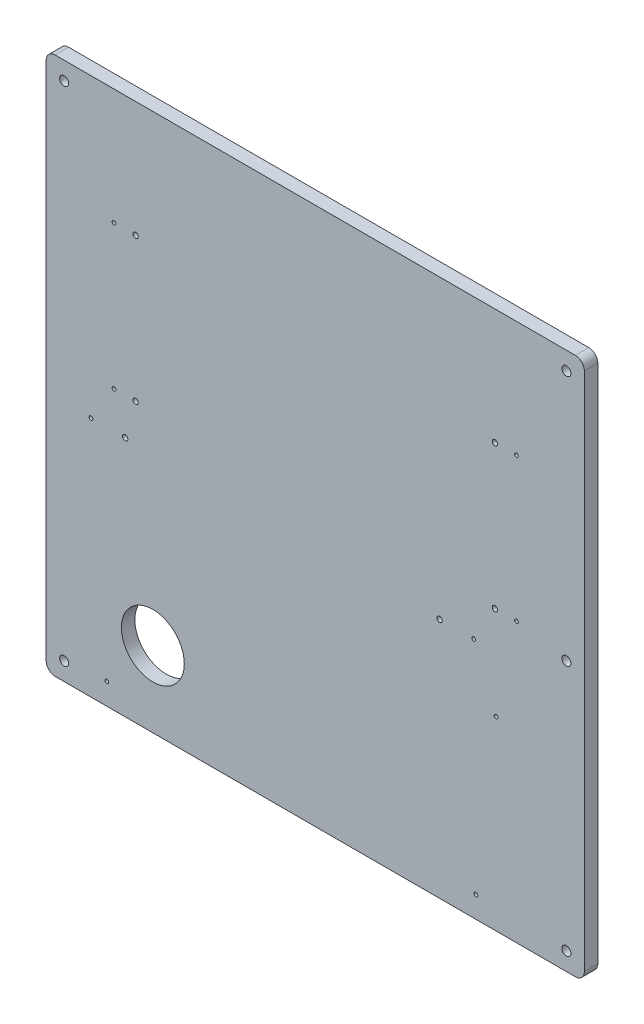
ISO-10303-21;
HEADER;
FILE_DESCRIPTION(('STEP AP214'),'2;1');
FILE_NAME('part.step','',(''),(''),'','','');
FILE_SCHEMA(('AUTOMOTIVE_DESIGN { 1 0 10303 214 1 1 1 1 }'));
ENDSEC;
DATA;
#1=APPLICATION_CONTEXT('core data for automotive mechanical design processes');
#2=APPLICATION_PROTOCOL_DEFINITION('international standard','automotive_design',2000,#1);
#3=PRODUCT_CONTEXT('',#1,'mechanical');
#4=PRODUCT('Part','Part','',(#3));
#5=PRODUCT_RELATED_PRODUCT_CATEGORY('part','',(#4));
#6=PRODUCT_DEFINITION_FORMATION('','',#4);
#7=PRODUCT_DEFINITION_CONTEXT('part definition',#1,'design');
#8=PRODUCT_DEFINITION('design','',#6,#7);
#9=PRODUCT_DEFINITION_SHAPE('','',#8);
#10=(LENGTH_UNIT() NAMED_UNIT(*) SI_UNIT(.MILLI.,.METRE.));
#11=(NAMED_UNIT(*) PLANE_ANGLE_UNIT() SI_UNIT($,.RADIAN.));
#12=(NAMED_UNIT(*) SI_UNIT($,.STERADIAN.) SOLID_ANGLE_UNIT());
#13=UNCERTAINTY_MEASURE_WITH_UNIT(LENGTH_MEASURE(1.E-05),#10,'distance_accuracy_value','');
#14=(GEOMETRIC_REPRESENTATION_CONTEXT(3) GLOBAL_UNCERTAINTY_ASSIGNED_CONTEXT((#13)) GLOBAL_UNIT_ASSIGNED_CONTEXT((#10,
#11,#12)) REPRESENTATION_CONTEXT('',''));
#15=CARTESIAN_POINT('',(0.,0.,0.));
#16=DIRECTION('',(0.,0.,1.));
#17=DIRECTION('',(1.,0.,0.));
#18=AXIS2_PLACEMENT_3D('',#15,#16,#17);
#19=CARTESIAN_POINT('',(299.5,-299.5,15.));
#20=DIRECTION('',(-1.,0.,0.));
#21=DIRECTION('',(0.,0.,1.));
#22=AXIS2_PLACEMENT_3D('',#19,#20,#21);
#23=PLANE('',#22);
#24=DIRECTION('',(0.,1.,0.));
#25=VECTOR('',#24,1.);
#26=CARTESIAN_POINT('',(299.5,-299.5,15.));
#27=LINE('',#26,#25);
#28=CARTESIAN_POINT('',(299.5,-289.5,15.));
#29=VERTEX_POINT('',#28);
#30=CARTESIAN_POINT('',(299.5,289.5,15.));
#31=VERTEX_POINT('',#30);
#32=EDGE_CURVE('E119',#29,#31,#27,.T.);
#33=ORIENTED_EDGE('',*,*,#32,.F.);
#34=DIRECTION('',(0.,0.,-1.));
#35=VECTOR('',#34,1.);
#36=CARTESIAN_POINT('',(299.5,-289.5,15.));
#37=LINE('',#36,#35);
#38=CARTESIAN_POINT('',(299.5,-289.5,0.));
#39=VERTEX_POINT('',#38);
#40=EDGE_CURVE('E104',#29,#39,#37,.T.);
#41=ORIENTED_EDGE('',*,*,#40,.T.);
#42=DIRECTION('',(0.,1.,0.));
#43=VECTOR('',#42,1.);
#44=CARTESIAN_POINT('',(299.5,-299.5,0.));
#45=LINE('',#44,#43);
#46=CARTESIAN_POINT('',(299.5,289.5,0.));
#47=VERTEX_POINT('',#46);
#48=EDGE_CURVE('E116',#39,#47,#45,.T.);
#49=ORIENTED_EDGE('',*,*,#48,.T.);
#50=DIRECTION('',(0.,0.,-1.));
#51=VECTOR('',#50,1.);
#52=CARTESIAN_POINT('',(299.5,289.5,15.));
#53=LINE('',#52,#51);
#54=EDGE_CURVE('E121',#47,#31,#53,.F.);
#55=ORIENTED_EDGE('',*,*,#54,.T.);
#56=EDGE_LOOP('',(#33,#41,#49,#55));
#57=FACE_BOUND('',#56,.T.);
#58=ADVANCED_FACE('F34',(#57),#23,.F.);
#59=CARTESIAN_POINT('',(-299.5,299.5,15.));
#60=DIRECTION('',(0.,-1.,0.));
#61=DIRECTION('',(0.,0.,-1.));
#62=AXIS2_PLACEMENT_3D('',#59,#60,#61);
#63=PLANE('',#62);
#64=DIRECTION('',(-1.,0.,0.));
#65=VECTOR('',#64,1.);
#66=CARTESIAN_POINT('',(-299.5,299.5,15.));
#67=LINE('',#66,#65);
#68=CARTESIAN_POINT('',(289.5,299.5,15.));
#69=VERTEX_POINT('',#68);
#70=CARTESIAN_POINT('',(-289.5,299.5,15.));
#71=VERTEX_POINT('',#70);
#72=EDGE_CURVE('E165',#69,#71,#67,.T.);
#73=ORIENTED_EDGE('',*,*,#72,.F.);
#74=DIRECTION('',(0.,0.,-1.));
#75=VECTOR('',#74,1.);
#76=CARTESIAN_POINT('',(289.5,299.5,15.));
#77=LINE('',#76,#75);
#78=CARTESIAN_POINT('',(289.5,299.5,0.));
#79=VERTEX_POINT('',#78);
#80=EDGE_CURVE('E158',#69,#79,#77,.T.);
#81=ORIENTED_EDGE('',*,*,#80,.T.);
#82=DIRECTION('',(-1.,0.,0.));
#83=VECTOR('',#82,1.);
#84=CARTESIAN_POINT('',(-299.5,299.5,0.));
#85=LINE('',#84,#83);
#86=CARTESIAN_POINT('',(-289.5,299.5,0.));
#87=VERTEX_POINT('',#86);
#88=EDGE_CURVE('E125',#79,#87,#85,.T.);
#89=ORIENTED_EDGE('',*,*,#88,.T.);
#90=DIRECTION('',(0.,0.,-1.));
#91=VECTOR('',#90,1.);
#92=CARTESIAN_POINT('',(-289.5,299.5,15.));
#93=LINE('',#92,#91);
#94=EDGE_CURVE('E156',#87,#71,#93,.F.);
#95=ORIENTED_EDGE('',*,*,#94,.T.);
#96=EDGE_LOOP('',(#73,#81,#89,#95));
#97=FACE_BOUND('',#96,.T.);
#98=ADVANCED_FACE('F163',(#97),#63,.F.);
#99=CARTESIAN_POINT('',(-299.5,-299.5,15.));
#100=DIRECTION('',(1.,0.,0.));
#101=DIRECTION('',(0.,0.,-1.));
#102=AXIS2_PLACEMENT_3D('',#99,#100,#101);
#103=PLANE('',#102);
#104=DIRECTION('',(0.,-1.,0.));
#105=VECTOR('',#104,1.);
#106=CARTESIAN_POINT('',(-299.5,-299.5,15.));
#107=LINE('',#106,#105);
#108=CARTESIAN_POINT('',(-299.5,289.5,15.));
#109=VERTEX_POINT('',#108);
#110=CARTESIAN_POINT('',(-299.5,-289.5,15.));
#111=VERTEX_POINT('',#110);
#112=EDGE_CURVE('E173',#109,#111,#107,.T.);
#113=ORIENTED_EDGE('',*,*,#112,.F.);
#114=DIRECTION('',(0.,0.,-1.));
#115=VECTOR('',#114,1.);
#116=CARTESIAN_POINT('',(-299.5,289.5,15.));
#117=LINE('',#116,#115);
#118=CARTESIAN_POINT('',(-299.5,289.5,0.));
#119=VERTEX_POINT('',#118);
#120=EDGE_CURVE('E11',#109,#119,#117,.T.);
#121=ORIENTED_EDGE('',*,*,#120,.T.);
#122=DIRECTION('',(0.,-1.,0.));
#123=VECTOR('',#122,1.);
#124=CARTESIAN_POINT('',(-299.5,-299.5,0.));
#125=LINE('',#124,#123);
#126=CARTESIAN_POINT('',(-299.5,-289.5,0.));
#127=VERTEX_POINT('',#126);
#128=EDGE_CURVE('E129',#119,#127,#125,.T.);
#129=ORIENTED_EDGE('',*,*,#128,.T.);
#130=DIRECTION('',(0.,0.,-1.));
#131=VECTOR('',#130,1.);
#132=CARTESIAN_POINT('',(-299.5,-289.5,15.));
#133=LINE('',#132,#131);
#134=EDGE_CURVE('E42',#127,#111,#133,.F.);
#135=ORIENTED_EDGE('',*,*,#134,.T.);
#136=EDGE_LOOP('',(#113,#121,#129,#135));
#137=FACE_BOUND('',#136,.T.);
#138=ADVANCED_FACE('F172',(#137),#103,.F.);
#139=CARTESIAN_POINT('',(-299.5,-299.5,15.));
#140=DIRECTION('',(0.,1.,0.));
#141=DIRECTION('',(0.,0.,1.));
#142=AXIS2_PLACEMENT_3D('',#139,#140,#141);
#143=PLANE('',#142);
#144=DIRECTION('',(1.,0.,0.));
#145=VECTOR('',#144,1.);
#146=CARTESIAN_POINT('',(-299.5,-299.5,0.));
#147=LINE('',#146,#145);
#148=CARTESIAN_POINT('',(-289.5,-299.5,0.));
#149=VERTEX_POINT('',#148);
#150=CARTESIAN_POINT('',(289.5,-299.5,0.));
#151=VERTEX_POINT('',#150);
#152=EDGE_CURVE('E139',#149,#151,#147,.T.);
#153=ORIENTED_EDGE('',*,*,#152,.T.);
#154=DIRECTION('',(0.,0.,-1.));
#155=VECTOR('',#154,1.);
#156=CARTESIAN_POINT('',(289.5,-299.5,15.));
#157=LINE('',#156,#155);
#158=CARTESIAN_POINT('',(289.5,-299.5,15.));
#159=VERTEX_POINT('',#158);
#160=EDGE_CURVE('E105',#151,#159,#157,.F.);
#161=ORIENTED_EDGE('',*,*,#160,.T.);
#162=DIRECTION('',(1.,0.,0.));
#163=VECTOR('',#162,1.);
#164=CARTESIAN_POINT('',(-299.5,-299.5,15.));
#165=LINE('',#164,#163);
#166=CARTESIAN_POINT('',(-289.5,-299.5,15.));
#167=VERTEX_POINT('',#166);
#168=EDGE_CURVE('E135',#167,#159,#165,.T.);
#169=ORIENTED_EDGE('',*,*,#168,.F.);
#170=DIRECTION('',(0.,0.,-1.));
#171=VECTOR('',#170,1.);
#172=CARTESIAN_POINT('',(-289.5,-299.5,15.));
#173=LINE('',#172,#171);
#174=EDGE_CURVE('E110',#167,#149,#173,.T.);
#175=ORIENTED_EDGE('',*,*,#174,.T.);
#176=EDGE_LOOP('',(#153,#161,#169,#175));
#177=FACE_BOUND('',#176,.T.);
#178=ADVANCED_FACE('F315',(#177),#143,.F.);
#179=CARTESIAN_POINT('',(0.,0.,15.));
#180=DIRECTION('',(0.,0.,-1.));
#181=DIRECTION('',(-1.,0.,0.));
#182=AXIS2_PLACEMENT_3D('',#179,#180,#181);
#183=PLANE('',#182);
#184=CARTESIAN_POINT('',(224.,170.5,15.));
#185=DIRECTION('',(0.,0.,1.));
#186=DIRECTION('',(1.,0.,0.));
#187=AXIS2_PLACEMENT_3D('',#184,#185,#186);
#188=CIRCLE('',#187,2.09999999999999);
#189=CARTESIAN_POINT('',(226.1,170.5,15.));
#190=VERTEX_POINT('',#189);
#191=EDGE_CURVE('E273',#190,#190,#188,.T.);
#192=ORIENTED_EDGE('',*,*,#191,.F.);
#193=EDGE_LOOP('',(#192));
#194=FACE_BOUND('',#193,.T.);
#195=CARTESIAN_POINT('',(224.,10.5000000000004,15.));
#196=DIRECTION('',(0.,0.,1.));
#197=DIRECTION('',(1.,0.,0.));
#198=AXIS2_PLACEMENT_3D('',#195,#196,#197);
#199=CIRCLE('',#198,2.09999999999999);
#200=CARTESIAN_POINT('',(226.1,10.5000000000004,15.));
#201=VERTEX_POINT('',#200);
#202=EDGE_CURVE('E267',#201,#201,#199,.T.);
#203=ORIENTED_EDGE('',*,*,#202,.F.);
#204=EDGE_LOOP('',(#203));
#205=FACE_BOUND('',#204,.T.);
#206=CARTESIAN_POINT('',(201.236161146576,-92.9824590337128,15.));
#207=DIRECTION('',(0.,0.,1.));
#208=DIRECTION('',(1.,0.,0.));
#209=AXIS2_PLACEMENT_3D('',#206,#207,#208);
#210=CIRCLE('',#209,2.09999999999999);
#211=CARTESIAN_POINT('',(203.336161146576,-92.9824590337128,15.));
#212=VERTEX_POINT('',#211);
#213=EDGE_CURVE('E261',#212,#212,#210,.T.);
#214=ORIENTED_EDGE('',*,*,#213,.F.);
#215=EDGE_LOOP('',(#214));
#216=FACE_BOUND('',#215,.T.);
#217=CARTESIAN_POINT('',(178.84999999997,-275.5,15.));
#218=DIRECTION('',(0.,0.,1.));
#219=DIRECTION('',(1.,0.,0.));
#220=AXIS2_PLACEMENT_3D('',#217,#218,#219);
#221=CIRCLE('',#220,2.09999999999999);
#222=CARTESIAN_POINT('',(180.94999999997,-275.5,15.));
#223=VERTEX_POINT('',#222);
#224=EDGE_CURVE('E254',#223,#223,#221,.T.);
#225=ORIENTED_EDGE('',*,*,#224,.F.);
#226=EDGE_LOOP('',(#225));
#227=FACE_BOUND('',#226,.T.);
#228=CARTESIAN_POINT('',(-231.950000000024,-275.5,15.));
#229=DIRECTION('',(0.,0.,1.));
#230=DIRECTION('',(1.,0.,0.));
#231=AXIS2_PLACEMENT_3D('',#228,#229,#230);
#232=CIRCLE('',#231,2.09999999999999);
#233=CARTESIAN_POINT('',(-229.850000000024,-275.5,15.));
#234=VERTEX_POINT('',#233);
#235=EDGE_CURVE('E296',#234,#234,#232,.T.);
#236=ORIENTED_EDGE('',*,*,#235,.F.);
#237=EDGE_LOOP('',(#236));
#238=FACE_BOUND('',#237,.T.);
#239=CARTESIAN_POINT('',(-249.600000000029,-30.5000000000001,15.));
#240=DIRECTION('',(0.,0.,1.));
#241=DIRECTION('',(1.,0.,0.));
#242=AXIS2_PLACEMENT_3D('',#239,#240,#241);
#243=CIRCLE('',#242,2.09999999999999);
#244=CARTESIAN_POINT('',(-247.500000000029,-30.5000000000001,15.));
#245=VERTEX_POINT('',#244);
#246=EDGE_CURVE('E290',#245,#245,#243,.T.);
#247=ORIENTED_EDGE('',*,*,#246,.F.);
#248=EDGE_LOOP('',(#247));
#249=FACE_BOUND('',#248,.T.);
#250=CARTESIAN_POINT('',(-224.,10.5000000000002,15.));
#251=DIRECTION('',(0.,0.,1.));
#252=DIRECTION('',(1.,0.,0.));
#253=AXIS2_PLACEMENT_3D('',#250,#251,#252);
#254=CIRCLE('',#253,2.09999999999999);
#255=CARTESIAN_POINT('',(-221.9,10.5000000000002,15.));
#256=VERTEX_POINT('',#255);
#257=EDGE_CURVE('E284',#256,#256,#254,.T.);
#258=ORIENTED_EDGE('',*,*,#257,.F.);
#259=EDGE_LOOP('',(#258));
#260=FACE_BOUND('',#259,.T.);
#261=CARTESIAN_POINT('',(176.399999999971,-30.5000000000001,15.));
#262=DIRECTION('',(0.,0.,1.));
#263=DIRECTION('',(1.,0.,0.));
#264=AXIS2_PLACEMENT_3D('',#261,#262,#263);
#265=CIRCLE('',#264,2.09999999999999);
#266=CARTESIAN_POINT('',(178.499999999971,-30.5000000000001,15.));
#267=VERTEX_POINT('',#266);
#268=EDGE_CURVE('E278',#267,#267,#265,.T.);
#269=ORIENTED_EDGE('',*,*,#268,.F.);
#270=EDGE_LOOP('',(#269));
#271=FACE_BOUND('',#270,.T.);
#272=CARTESIAN_POINT('',(-224.,170.500000000001,15.));
#273=DIRECTION('',(0.,0.,1.));
#274=DIRECTION('',(1.,0.,0.));
#275=AXIS2_PLACEMENT_3D('',#272,#273,#274);
#276=CIRCLE('',#275,2.09999999999999);
#277=CARTESIAN_POINT('',(-221.9,170.500000000001,15.));
#278=VERTEX_POINT('',#277);
#279=EDGE_CURVE('E248',#278,#278,#276,.T.);
#280=ORIENTED_EDGE('',*,*,#279,.F.);
#281=EDGE_LOOP('',(#280));
#282=FACE_BOUND('',#281,.T.);
#283=CARTESIAN_POINT('',(-211.600000000029,-30.5000000000001,15.));
#284=DIRECTION('',(0.,0.,1.));
#285=DIRECTION('',(1.,0.,0.));
#286=AXIS2_PLACEMENT_3D('',#283,#284,#285);
#287=CIRCLE('',#286,2.99999999999999);
#288=CARTESIAN_POINT('',(-208.600000000029,-30.5000000000001,15.));
#289=VERTEX_POINT('',#288);
#290=EDGE_CURVE('E218',#289,#289,#287,.T.);
#291=ORIENTED_EDGE('',*,*,#290,.F.);
#292=EDGE_LOOP('',(#291));
#293=FACE_BOUND('',#292,.T.);
#294=CARTESIAN_POINT('',(-199.999999999994,10.4999999999996,15.));
#295=DIRECTION('',(0.,0.,1.));
#296=DIRECTION('',(1.,0.,0.));
#297=AXIS2_PLACEMENT_3D('',#294,#295,#296);
#298=CIRCLE('',#297,2.99999999999313);
#299=CARTESIAN_POINT('',(-197.000000000001,10.4999999999996,15.));
#300=VERTEX_POINT('',#299);
#301=EDGE_CURVE('E233',#300,#300,#298,.T.);
#302=ORIENTED_EDGE('',*,*,#301,.F.);
#303=EDGE_LOOP('',(#302));
#304=FACE_BOUND('',#303,.T.);
#305=CARTESIAN_POINT('',(200.000000000006,170.5,15.));
#306=DIRECTION('',(0.,0.,1.));
#307=DIRECTION('',(1.,0.,0.));
#308=AXIS2_PLACEMENT_3D('',#305,#306,#307);
#309=CIRCLE('',#308,2.99999999999326);
#310=CARTESIAN_POINT('',(203.,170.5,15.));
#311=VERTEX_POINT('',#310);
#312=EDGE_CURVE('E226',#311,#311,#309,.T.);
#313=ORIENTED_EDGE('',*,*,#312,.F.);
#314=EDGE_LOOP('',(#313));
#315=FACE_BOUND('',#314,.T.);
#316=CARTESIAN_POINT('',(200.000000000006,10.4999999999996,15.));
#317=DIRECTION('',(0.,0.,1.));
#318=DIRECTION('',(1.,0.,0.));
#319=AXIS2_PLACEMENT_3D('',#316,#317,#318);
#320=CIRCLE('',#319,2.9999999999931);
#321=CARTESIAN_POINT('',(202.999999999999,10.4999999999996,15.));
#322=VERTEX_POINT('',#321);
#323=EDGE_CURVE('E243',#322,#322,#320,.T.);
#324=ORIENTED_EDGE('',*,*,#323,.F.);
#325=EDGE_LOOP('',(#324));
#326=FACE_BOUND('',#325,.T.);
#327=CARTESIAN_POINT('',(138.399999999971,-30.5000000000001,15.));
#328=DIRECTION('',(0.,0.,1.));
#329=DIRECTION('',(1.,0.,0.));
#330=AXIS2_PLACEMENT_3D('',#327,#328,#329);
#331=CIRCLE('',#330,2.99999999999999);
#332=CARTESIAN_POINT('',(141.399999999971,-30.5000000000001,15.));
#333=VERTEX_POINT('',#332);
#334=EDGE_CURVE('E225',#333,#333,#331,.T.);
#335=ORIENTED_EDGE('',*,*,#334,.F.);
#336=EDGE_LOOP('',(#335));
#337=FACE_BOUND('',#336,.T.);
#338=CARTESIAN_POINT('',(-199.999999999994,170.5,15.));
#339=DIRECTION('',(0.,0.,1.));
#340=DIRECTION('',(1.,0.,0.));
#341=AXIS2_PLACEMENT_3D('',#338,#339,#340);
#342=CIRCLE('',#341,2.9999999999931);
#343=CARTESIAN_POINT('',(-197.000000000001,170.5,15.));
#344=VERTEX_POINT('',#343);
#345=EDGE_CURVE('E212',#344,#344,#342,.T.);
#346=ORIENTED_EDGE('',*,*,#345,.F.);
#347=EDGE_LOOP('',(#346));
#348=FACE_BOUND('',#347,.T.);
#349=CARTESIAN_POINT('',(-180.79,-215.5,15.));
#350=DIRECTION('',(0.,0.,1.));
#351=DIRECTION('',(1.,0.,0.));
#352=AXIS2_PLACEMENT_3D('',#349,#350,#351);
#353=CIRCLE('',#352,35.);
#354=CARTESIAN_POINT('',(-145.79,-215.5,15.));
#355=VERTEX_POINT('',#354);
#356=EDGE_CURVE('E206',#355,#355,#353,.T.);
#357=ORIENTED_EDGE('',*,*,#356,.F.);
#358=EDGE_LOOP('',(#357));
#359=FACE_BOUND('',#358,.T.);
#360=CARTESIAN_POINT('',(279.5,-279.5,15.));
#361=DIRECTION('',(0.,0.,1.));
#362=DIRECTION('',(1.,0.,0.));
#363=AXIS2_PLACEMENT_3D('',#360,#361,#362);
#364=CIRCLE('',#363,4.99999999999999);
#365=CARTESIAN_POINT('',(284.5,-279.5,15.));
#366=VERTEX_POINT('',#365);
#367=EDGE_CURVE('E189',#366,#366,#364,.T.);
#368=ORIENTED_EDGE('',*,*,#367,.F.);
#369=EDGE_LOOP('',(#368));
#370=FACE_BOUND('',#369,.T.);
#371=CARTESIAN_POINT('',(-279.5,279.5,15.));
#372=DIRECTION('',(0.,0.,1.));
#373=DIRECTION('',(1.,0.,0.));
#374=AXIS2_PLACEMENT_3D('',#371,#372,#373);
#375=CIRCLE('',#374,4.99999999999999);
#376=CARTESIAN_POINT('',(-274.5,279.5,15.));
#377=VERTEX_POINT('',#376);
#378=EDGE_CURVE('E182',#377,#377,#375,.T.);
#379=ORIENTED_EDGE('',*,*,#378,.F.);
#380=EDGE_LOOP('',(#379));
#381=FACE_BOUND('',#380,.T.);
#382=CARTESIAN_POINT('',(279.5,279.5,15.));
#383=DIRECTION('',(0.,0.,1.));
#384=DIRECTION('',(1.,0.,0.));
#385=AXIS2_PLACEMENT_3D('',#382,#383,#384);
#386=CIRCLE('',#385,4.99999999999999);
#387=CARTESIAN_POINT('',(284.5,279.5,15.));
#388=VERTEX_POINT('',#387);
#389=EDGE_CURVE('E201',#388,#388,#386,.T.);
#390=ORIENTED_EDGE('',*,*,#389,.F.);
#391=EDGE_LOOP('',(#390));
#392=FACE_BOUND('',#391,.T.);
#393=CARTESIAN_POINT('',(279.5,0.,15.));
#394=DIRECTION('',(0.,0.,1.));
#395=DIRECTION('',(1.,0.,0.));
#396=AXIS2_PLACEMENT_3D('',#393,#394,#395);
#397=CIRCLE('',#396,4.99999999999999);
#398=CARTESIAN_POINT('',(284.5,0.,15.));
#399=VERTEX_POINT('',#398);
#400=EDGE_CURVE('E194',#399,#399,#397,.T.);
#401=ORIENTED_EDGE('',*,*,#400,.F.);
#402=EDGE_LOOP('',(#401));
#403=FACE_BOUND('',#402,.T.);
#404=CARTESIAN_POINT('',(-279.5,-279.5,15.));
#405=DIRECTION('',(0.,0.,1.));
#406=DIRECTION('',(1.,0.,0.));
#407=AXIS2_PLACEMENT_3D('',#404,#405,#406);
#408=CIRCLE('',#407,4.99999999999999);
#409=CARTESIAN_POINT('',(-274.5,-279.5,15.));
#410=VERTEX_POINT('',#409);
#411=EDGE_CURVE('E132',#410,#410,#408,.T.);
#412=ORIENTED_EDGE('',*,*,#411,.F.);
#413=EDGE_LOOP('',(#412));
#414=FACE_BOUND('',#413,.T.);
#415=ORIENTED_EDGE('',*,*,#168,.T.);
#416=CARTESIAN_POINT('',(289.5,-289.5,15.));
#417=DIRECTION('',(0.,0.,-1.));
#418=DIRECTION('',(-1.,0.,0.));
#419=AXIS2_PLACEMENT_3D('',#416,#417,#418);
#420=CIRCLE('',#419,10.);
#421=EDGE_CURVE('E154',#159,#29,#420,.F.);
#422=ORIENTED_EDGE('',*,*,#421,.T.);
#423=ORIENTED_EDGE('',*,*,#32,.T.);
#424=CARTESIAN_POINT('',(289.5,289.5,15.));
#425=DIRECTION('',(0.,0.,-1.));
#426=DIRECTION('',(-1.,0.,0.));
#427=AXIS2_PLACEMENT_3D('',#424,#425,#426);
#428=CIRCLE('',#427,10.);
#429=EDGE_CURVE('E152',#31,#69,#428,.F.);
#430=ORIENTED_EDGE('',*,*,#429,.T.);
#431=ORIENTED_EDGE('',*,*,#72,.T.);
#432=CARTESIAN_POINT('',(-289.5,289.5,15.));
#433=DIRECTION('',(0.,0.,-1.));
#434=DIRECTION('',(-1.,0.,0.));
#435=AXIS2_PLACEMENT_3D('',#432,#433,#434);
#436=CIRCLE('',#435,10.);
#437=EDGE_CURVE('E55',#71,#109,#436,.F.);
#438=ORIENTED_EDGE('',*,*,#437,.T.);
#439=ORIENTED_EDGE('',*,*,#112,.T.);
#440=CARTESIAN_POINT('',(-289.5,-289.5,15.));
#441=DIRECTION('',(0.,0.,-1.));
#442=DIRECTION('',(-1.,0.,0.));
#443=AXIS2_PLACEMENT_3D('',#440,#441,#442);
#444=CIRCLE('',#443,10.);
#445=EDGE_CURVE('E149',#111,#167,#444,.F.);
#446=ORIENTED_EDGE('',*,*,#445,.T.);
#447=EDGE_LOOP('',(#415,#422,#423,#430,#431,#438,#439,#446));
#448=FACE_BOUND('',#447,.T.);
#449=ADVANCED_FACE('F312',(#194,#205,#216,#227,#238,#249,#260,#271,#282,#293,#304,#315,#326,
#337,#348,#359,#370,#381,#392,#403,#414,#448),#183,.F.);
#450=CARTESIAN_POINT('',(0.,0.,0.));
#451=DIRECTION('',(0.,0.,-1.));
#452=DIRECTION('',(-1.,0.,0.));
#453=AXIS2_PLACEMENT_3D('',#450,#451,#452);
#454=PLANE('',#453);
#455=CARTESIAN_POINT('',(224.,170.5,0.));
#456=DIRECTION('',(0.,0.,1.));
#457=DIRECTION('',(1.,0.,0.));
#458=AXIS2_PLACEMENT_3D('',#455,#456,#457);
#459=CIRCLE('',#458,2.09999999999999);
#460=CARTESIAN_POINT('',(226.1,170.5,0.));
#461=VERTEX_POINT('',#460);
#462=EDGE_CURVE('E251',#461,#461,#459,.T.);
#463=ORIENTED_EDGE('',*,*,#462,.T.);
#464=EDGE_LOOP('',(#463));
#465=FACE_BOUND('',#464,.T.);
#466=CARTESIAN_POINT('',(224.,10.5000000000004,0.));
#467=DIRECTION('',(0.,0.,1.));
#468=DIRECTION('',(1.,0.,0.));
#469=AXIS2_PLACEMENT_3D('',#466,#467,#468);
#470=CIRCLE('',#469,2.09999999999999);
#471=CARTESIAN_POINT('',(226.1,10.5000000000004,0.));
#472=VERTEX_POINT('',#471);
#473=EDGE_CURVE('E270',#472,#472,#470,.T.);
#474=ORIENTED_EDGE('',*,*,#473,.T.);
#475=EDGE_LOOP('',(#474));
#476=FACE_BOUND('',#475,.T.);
#477=CARTESIAN_POINT('',(201.236161146576,-92.9824590337128,0.));
#478=DIRECTION('',(0.,0.,1.));
#479=DIRECTION('',(1.,0.,0.));
#480=AXIS2_PLACEMENT_3D('',#477,#478,#479);
#481=CIRCLE('',#480,2.09999999999999);
#482=CARTESIAN_POINT('',(203.336161146576,-92.9824590337128,0.));
#483=VERTEX_POINT('',#482);
#484=EDGE_CURVE('E264',#483,#483,#481,.T.);
#485=ORIENTED_EDGE('',*,*,#484,.T.);
#486=EDGE_LOOP('',(#485));
#487=FACE_BOUND('',#486,.T.);
#488=CARTESIAN_POINT('',(178.84999999997,-275.5,0.));
#489=DIRECTION('',(0.,0.,1.));
#490=DIRECTION('',(1.,0.,0.));
#491=AXIS2_PLACEMENT_3D('',#488,#489,#490);
#492=CIRCLE('',#491,2.09999999999999);
#493=CARTESIAN_POINT('',(180.94999999997,-275.5,0.));
#494=VERTEX_POINT('',#493);
#495=EDGE_CURVE('E257',#494,#494,#492,.T.);
#496=ORIENTED_EDGE('',*,*,#495,.T.);
#497=EDGE_LOOP('',(#496));
#498=FACE_BOUND('',#497,.T.);
#499=CARTESIAN_POINT('',(-231.950000000024,-275.5,0.));
#500=DIRECTION('',(0.,0.,1.));
#501=DIRECTION('',(1.,0.,0.));
#502=AXIS2_PLACEMENT_3D('',#499,#500,#501);
#503=CIRCLE('',#502,2.09999999999999);
#504=CARTESIAN_POINT('',(-229.850000000024,-275.5,0.));
#505=VERTEX_POINT('',#504);
#506=EDGE_CURVE('E258',#505,#505,#503,.T.);
#507=ORIENTED_EDGE('',*,*,#506,.T.);
#508=EDGE_LOOP('',(#507));
#509=FACE_BOUND('',#508,.T.);
#510=CARTESIAN_POINT('',(-249.600000000029,-30.5000000000001,0.));
#511=DIRECTION('',(0.,0.,1.));
#512=DIRECTION('',(1.,0.,0.));
#513=AXIS2_PLACEMENT_3D('',#510,#511,#512);
#514=CIRCLE('',#513,2.09999999999999);
#515=CARTESIAN_POINT('',(-247.500000000029,-30.5000000000001,0.));
#516=VERTEX_POINT('',#515);
#517=EDGE_CURVE('E293',#516,#516,#514,.T.);
#518=ORIENTED_EDGE('',*,*,#517,.T.);
#519=EDGE_LOOP('',(#518));
#520=FACE_BOUND('',#519,.T.);
#521=CARTESIAN_POINT('',(-224.,10.5000000000002,0.));
#522=DIRECTION('',(0.,0.,1.));
#523=DIRECTION('',(1.,0.,0.));
#524=AXIS2_PLACEMENT_3D('',#521,#522,#523);
#525=CIRCLE('',#524,2.09999999999999);
#526=CARTESIAN_POINT('',(-221.9,10.5000000000002,0.));
#527=VERTEX_POINT('',#526);
#528=EDGE_CURVE('E287',#527,#527,#525,.T.);
#529=ORIENTED_EDGE('',*,*,#528,.T.);
#530=EDGE_LOOP('',(#529));
#531=FACE_BOUND('',#530,.T.);
#532=CARTESIAN_POINT('',(176.399999999971,-30.5000000000001,0.));
#533=DIRECTION('',(0.,0.,1.));
#534=DIRECTION('',(1.,0.,0.));
#535=AXIS2_PLACEMENT_3D('',#532,#533,#534);
#536=CIRCLE('',#535,2.09999999999999);
#537=CARTESIAN_POINT('',(178.499999999971,-30.5000000000001,0.));
#538=VERTEX_POINT('',#537);
#539=EDGE_CURVE('E281',#538,#538,#536,.T.);
#540=ORIENTED_EDGE('',*,*,#539,.T.);
#541=EDGE_LOOP('',(#540));
#542=FACE_BOUND('',#541,.T.);
#543=CARTESIAN_POINT('',(-224.,170.500000000001,0.));
#544=DIRECTION('',(0.,0.,1.));
#545=DIRECTION('',(1.,0.,0.));
#546=AXIS2_PLACEMENT_3D('',#543,#544,#545);
#547=CIRCLE('',#546,2.09999999999999);
#548=CARTESIAN_POINT('',(-221.9,170.500000000001,0.));
#549=VERTEX_POINT('',#548);
#550=EDGE_CURVE('E222',#549,#549,#547,.T.);
#551=ORIENTED_EDGE('',*,*,#550,.T.);
#552=EDGE_LOOP('',(#551));
#553=FACE_BOUND('',#552,.T.);
#554=CARTESIAN_POINT('',(-211.600000000029,-30.5000000000001,0.));
#555=DIRECTION('',(0.,0.,1.));
#556=DIRECTION('',(1.,0.,0.));
#557=AXIS2_PLACEMENT_3D('',#554,#555,#556);
#558=CIRCLE('',#557,2.99999999999999);
#559=CARTESIAN_POINT('',(-208.600000000029,-30.5000000000001,0.));
#560=VERTEX_POINT('',#559);
#561=EDGE_CURVE('E221',#560,#560,#558,.T.);
#562=ORIENTED_EDGE('',*,*,#561,.T.);
#563=EDGE_LOOP('',(#562));
#564=FACE_BOUND('',#563,.T.);
#565=CARTESIAN_POINT('',(-199.999999999994,10.4999999999996,0.));
#566=DIRECTION('',(0.,0.,1.));
#567=DIRECTION('',(1.,0.,0.));
#568=AXIS2_PLACEMENT_3D('',#565,#566,#567);
#569=CIRCLE('',#568,2.99999999999313);
#570=CARTESIAN_POINT('',(-197.000000000001,10.4999999999996,0.));
#571=VERTEX_POINT('',#570);
#572=EDGE_CURVE('E215',#571,#571,#569,.T.);
#573=ORIENTED_EDGE('',*,*,#572,.T.);
#574=EDGE_LOOP('',(#573));
#575=FACE_BOUND('',#574,.T.);
#576=CARTESIAN_POINT('',(200.000000000006,170.5,0.));
#577=DIRECTION('',(0.,0.,1.));
#578=DIRECTION('',(1.,0.,0.));
#579=AXIS2_PLACEMENT_3D('',#576,#577,#578);
#580=CIRCLE('',#579,2.99999999999326);
#581=CARTESIAN_POINT('',(203.,170.5,0.));
#582=VERTEX_POINT('',#581);
#583=EDGE_CURVE('E229',#582,#582,#580,.T.);
#584=ORIENTED_EDGE('',*,*,#583,.T.);
#585=EDGE_LOOP('',(#584));
#586=FACE_BOUND('',#585,.T.);
#587=CARTESIAN_POINT('',(200.000000000006,10.4999999999996,0.));
#588=DIRECTION('',(0.,0.,1.));
#589=DIRECTION('',(1.,0.,0.));
#590=AXIS2_PLACEMENT_3D('',#587,#588,#589);
#591=CIRCLE('',#590,2.9999999999931);
#592=CARTESIAN_POINT('',(202.999999999999,10.4999999999996,0.));
#593=VERTEX_POINT('',#592);
#594=EDGE_CURVE('E230',#593,#593,#591,.T.);
#595=ORIENTED_EDGE('',*,*,#594,.T.);
#596=EDGE_LOOP('',(#595));
#597=FACE_BOUND('',#596,.T.);
#598=CARTESIAN_POINT('',(138.399999999971,-30.5000000000001,0.));
#599=DIRECTION('',(0.,0.,1.));
#600=DIRECTION('',(1.,0.,0.));
#601=AXIS2_PLACEMENT_3D('',#598,#599,#600);
#602=CIRCLE('',#601,2.99999999999999);
#603=CARTESIAN_POINT('',(141.399999999971,-30.5000000000001,0.));
#604=VERTEX_POINT('',#603);
#605=EDGE_CURVE('E240',#604,#604,#602,.T.);
#606=ORIENTED_EDGE('',*,*,#605,.T.);
#607=EDGE_LOOP('',(#606));
#608=FACE_BOUND('',#607,.T.);
#609=CARTESIAN_POINT('',(-199.999999999994,170.5,0.));
#610=DIRECTION('',(0.,0.,1.));
#611=DIRECTION('',(1.,0.,0.));
#612=AXIS2_PLACEMENT_3D('',#609,#610,#611);
#613=CIRCLE('',#612,2.9999999999931);
#614=CARTESIAN_POINT('',(-197.000000000001,170.5,0.));
#615=VERTEX_POINT('',#614);
#616=EDGE_CURVE('E209',#615,#615,#613,.T.);
#617=ORIENTED_EDGE('',*,*,#616,.T.);
#618=EDGE_LOOP('',(#617));
#619=FACE_BOUND('',#618,.T.);
#620=CARTESIAN_POINT('',(-180.79,-215.5,0.));
#621=DIRECTION('',(0.,0.,1.));
#622=DIRECTION('',(1.,0.,0.));
#623=AXIS2_PLACEMENT_3D('',#620,#621,#622);
#624=CIRCLE('',#623,35.);
#625=CARTESIAN_POINT('',(-145.79,-215.5,0.));
#626=VERTEX_POINT('',#625);
#627=EDGE_CURVE('E198',#626,#626,#624,.T.);
#628=ORIENTED_EDGE('',*,*,#627,.T.);
#629=EDGE_LOOP('',(#628));
#630=FACE_BOUND('',#629,.T.);
#631=CARTESIAN_POINT('',(279.5,-279.5,0.));
#632=DIRECTION('',(0.,0.,1.));
#633=DIRECTION('',(1.,0.,0.));
#634=AXIS2_PLACEMENT_3D('',#631,#632,#633);
#635=CIRCLE('',#634,4.99999999999999);
#636=CARTESIAN_POINT('',(284.5,-279.5,0.));
#637=VERTEX_POINT('',#636);
#638=EDGE_CURVE('E180',#637,#637,#635,.T.);
#639=ORIENTED_EDGE('',*,*,#638,.T.);
#640=EDGE_LOOP('',(#639));
#641=FACE_BOUND('',#640,.T.);
#642=CARTESIAN_POINT('',(-279.5,279.5,0.));
#643=DIRECTION('',(0.,0.,1.));
#644=DIRECTION('',(1.,0.,0.));
#645=AXIS2_PLACEMENT_3D('',#642,#643,#644);
#646=CIRCLE('',#645,4.99999999999999);
#647=CARTESIAN_POINT('',(-274.5,279.5,0.));
#648=VERTEX_POINT('',#647);
#649=EDGE_CURVE('E185',#648,#648,#646,.T.);
#650=ORIENTED_EDGE('',*,*,#649,.T.);
#651=EDGE_LOOP('',(#650));
#652=FACE_BOUND('',#651,.T.);
#653=CARTESIAN_POINT('',(279.5,279.5,0.));
#654=DIRECTION('',(0.,0.,1.));
#655=DIRECTION('',(1.,0.,0.));
#656=AXIS2_PLACEMENT_3D('',#653,#654,#655);
#657=CIRCLE('',#656,4.99999999999999);
#658=CARTESIAN_POINT('',(284.5,279.5,0.));
#659=VERTEX_POINT('',#658);
#660=EDGE_CURVE('E186',#659,#659,#657,.T.);
#661=ORIENTED_EDGE('',*,*,#660,.T.);
#662=EDGE_LOOP('',(#661));
#663=FACE_BOUND('',#662,.T.);
#664=CARTESIAN_POINT('',(279.5,0.,0.));
#665=DIRECTION('',(0.,0.,1.));
#666=DIRECTION('',(1.,0.,0.));
#667=AXIS2_PLACEMENT_3D('',#664,#665,#666);
#668=CIRCLE('',#667,4.99999999999999);
#669=CARTESIAN_POINT('',(284.5,0.,0.));
#670=VERTEX_POINT('',#669);
#671=EDGE_CURVE('E197',#670,#670,#668,.T.);
#672=ORIENTED_EDGE('',*,*,#671,.T.);
#673=EDGE_LOOP('',(#672));
#674=FACE_BOUND('',#673,.T.);
#675=CARTESIAN_POINT('',(-279.5,-279.5,0.));
#676=DIRECTION('',(0.,0.,1.));
#677=DIRECTION('',(1.,0.,0.));
#678=AXIS2_PLACEMENT_3D('',#675,#676,#677);
#679=CIRCLE('',#678,4.99999999999999);
#680=CARTESIAN_POINT('',(-274.5,-279.5,0.));
#681=VERTEX_POINT('',#680);
#682=EDGE_CURVE('E126',#681,#681,#679,.T.);
#683=ORIENTED_EDGE('',*,*,#682,.T.);
#684=EDGE_LOOP('',(#683));
#685=FACE_BOUND('',#684,.T.);
#686=ORIENTED_EDGE('',*,*,#48,.F.);
#687=CARTESIAN_POINT('',(289.5,-289.5,0.));
#688=DIRECTION('',(0.,0.,-1.));
#689=DIRECTION('',(-1.,0.,0.));
#690=AXIS2_PLACEMENT_3D('',#687,#688,#689);
#691=CIRCLE('',#690,10.);
#692=EDGE_CURVE('E100',#39,#151,#691,.T.);
#693=ORIENTED_EDGE('',*,*,#692,.T.);
#694=ORIENTED_EDGE('',*,*,#152,.F.);
#695=CARTESIAN_POINT('',(-289.5,-289.5,0.));
#696=DIRECTION('',(0.,0.,-1.));
#697=DIRECTION('',(-1.,0.,0.));
#698=AXIS2_PLACEMENT_3D('',#695,#696,#697);
#699=CIRCLE('',#698,10.);
#700=EDGE_CURVE('E120',#149,#127,#699,.T.);
#701=ORIENTED_EDGE('',*,*,#700,.T.);
#702=ORIENTED_EDGE('',*,*,#128,.F.);
#703=CARTESIAN_POINT('',(-289.5,289.5,0.));
#704=DIRECTION('',(0.,0.,-1.));
#705=DIRECTION('',(-1.,0.,0.));
#706=AXIS2_PLACEMENT_3D('',#703,#704,#705);
#707=CIRCLE('',#706,10.);
#708=EDGE_CURVE('E143',#119,#87,#707,.T.);
#709=ORIENTED_EDGE('',*,*,#708,.T.);
#710=ORIENTED_EDGE('',*,*,#88,.F.);
#711=CARTESIAN_POINT('',(289.5,289.5,0.));
#712=DIRECTION('',(0.,0.,-1.));
#713=DIRECTION('',(-1.,0.,0.));
#714=AXIS2_PLACEMENT_3D('',#711,#712,#713);
#715=CIRCLE('',#714,10.);
#716=EDGE_CURVE('E111',#79,#47,#715,.T.);
#717=ORIENTED_EDGE('',*,*,#716,.T.);
#718=EDGE_LOOP('',(#686,#693,#694,#701,#702,#709,#710,#717));
#719=FACE_BOUND('',#718,.T.);
#720=ADVANCED_FACE('F123',(#465,#476,#487,#498,#509,#520,#531,#542,#553,#564,#575,#586,#597,
#608,#619,#630,#641,#652,#663,#674,#685,#719),#454,.T.);
#721=CARTESIAN_POINT('',(-279.5,-279.5,0.));
#722=DIRECTION('',(0.,0.,1.));
#723=DIRECTION('',(1.,0.,0.));
#724=AXIS2_PLACEMENT_3D('',#721,#722,#723);
#725=CYLINDRICAL_SURFACE('',#724,4.99999999999999);
#726=ORIENTED_EDGE('',*,*,#682,.F.);
#727=EDGE_LOOP('',(#726));
#728=FACE_BOUND('',#727,.T.);
#729=ORIENTED_EDGE('',*,*,#411,.T.);
#730=EDGE_LOOP('',(#729));
#731=FACE_BOUND('',#730,.T.);
#732=ADVANCED_FACE('F473',(#728,#731),#725,.F.);
#733=CARTESIAN_POINT('',(279.5,0.,0.));
#734=DIRECTION('',(0.,0.,1.));
#735=DIRECTION('',(1.,0.,0.));
#736=AXIS2_PLACEMENT_3D('',#733,#734,#735);
#737=CYLINDRICAL_SURFACE('',#736,4.99999999999999);
#738=ORIENTED_EDGE('',*,*,#671,.F.);
#739=EDGE_LOOP('',(#738));
#740=FACE_BOUND('',#739,.T.);
#741=ORIENTED_EDGE('',*,*,#400,.T.);
#742=EDGE_LOOP('',(#741));
#743=FACE_BOUND('',#742,.T.);
#744=ADVANCED_FACE('F568',(#740,#743),#737,.F.);
#745=CARTESIAN_POINT('',(279.5,279.5,0.));
#746=DIRECTION('',(0.,0.,1.));
#747=DIRECTION('',(1.,0.,0.));
#748=AXIS2_PLACEMENT_3D('',#745,#746,#747);
#749=CYLINDRICAL_SURFACE('',#748,4.99999999999999);
#750=ORIENTED_EDGE('',*,*,#660,.F.);
#751=EDGE_LOOP('',(#750));
#752=FACE_BOUND('',#751,.T.);
#753=ORIENTED_EDGE('',*,*,#389,.T.);
#754=EDGE_LOOP('',(#753));
#755=FACE_BOUND('',#754,.T.);
#756=ADVANCED_FACE('F564',(#752,#755),#749,.F.);
#757=CARTESIAN_POINT('',(-279.5,279.5,0.));
#758=DIRECTION('',(0.,0.,1.));
#759=DIRECTION('',(1.,0.,0.));
#760=AXIS2_PLACEMENT_3D('',#757,#758,#759);
#761=CYLINDRICAL_SURFACE('',#760,4.99999999999999);
#762=ORIENTED_EDGE('',*,*,#649,.F.);
#763=EDGE_LOOP('',(#762));
#764=FACE_BOUND('',#763,.T.);
#765=ORIENTED_EDGE('',*,*,#378,.T.);
#766=EDGE_LOOP('',(#765));
#767=FACE_BOUND('',#766,.T.);
#768=ADVANCED_FACE('F567',(#764,#767),#761,.F.);
#769=CARTESIAN_POINT('',(279.5,-279.5,0.));
#770=DIRECTION('',(0.,0.,1.));
#771=DIRECTION('',(1.,0.,0.));
#772=AXIS2_PLACEMENT_3D('',#769,#770,#771);
#773=CYLINDRICAL_SURFACE('',#772,4.99999999999999);
#774=ORIENTED_EDGE('',*,*,#638,.F.);
#775=EDGE_LOOP('',(#774));
#776=FACE_BOUND('',#775,.T.);
#777=ORIENTED_EDGE('',*,*,#367,.T.);
#778=EDGE_LOOP('',(#777));
#779=FACE_BOUND('',#778,.T.);
#780=ADVANCED_FACE('F373',(#776,#779),#773,.F.);
#781=CARTESIAN_POINT('',(289.5,-289.5,15.));
#782=DIRECTION('',(0.,0.,-1.));
#783=DIRECTION('',(-1.,0.,0.));
#784=AXIS2_PLACEMENT_3D('',#781,#782,#783);
#785=CYLINDRICAL_SURFACE('',#784,10.);
#786=ORIENTED_EDGE('',*,*,#421,.F.);
#787=ORIENTED_EDGE('',*,*,#160,.F.);
#788=ORIENTED_EDGE('',*,*,#692,.F.);
#789=ORIENTED_EDGE('',*,*,#40,.F.);
#790=EDGE_LOOP('',(#786,#787,#788,#789));
#791=FACE_BOUND('',#790,.T.);
#792=ADVANCED_FACE('F103',(#791),#785,.T.);
#793=CARTESIAN_POINT('',(289.5,289.5,15.));
#794=DIRECTION('',(0.,0.,-1.));
#795=DIRECTION('',(-1.,0.,0.));
#796=AXIS2_PLACEMENT_3D('',#793,#794,#795);
#797=CYLINDRICAL_SURFACE('',#796,10.);
#798=ORIENTED_EDGE('',*,*,#429,.F.);
#799=ORIENTED_EDGE('',*,*,#54,.F.);
#800=ORIENTED_EDGE('',*,*,#716,.F.);
#801=ORIENTED_EDGE('',*,*,#80,.F.);
#802=EDGE_LOOP('',(#798,#799,#800,#801));
#803=FACE_BOUND('',#802,.T.);
#804=ADVANCED_FACE('F362',(#803),#797,.T.);
#805=CARTESIAN_POINT('',(-289.5,289.5,15.));
#806=DIRECTION('',(0.,0.,-1.));
#807=DIRECTION('',(-1.,0.,0.));
#808=AXIS2_PLACEMENT_3D('',#805,#806,#807);
#809=CYLINDRICAL_SURFACE('',#808,10.);
#810=ORIENTED_EDGE('',*,*,#437,.F.);
#811=ORIENTED_EDGE('',*,*,#94,.F.);
#812=ORIENTED_EDGE('',*,*,#708,.F.);
#813=ORIENTED_EDGE('',*,*,#120,.F.);
#814=EDGE_LOOP('',(#810,#811,#812,#813));
#815=FACE_BOUND('',#814,.T.);
#816=ADVANCED_FACE('F171',(#815),#809,.T.);
#817=CARTESIAN_POINT('',(-289.5,-289.5,15.));
#818=DIRECTION('',(0.,0.,-1.));
#819=DIRECTION('',(-1.,0.,0.));
#820=AXIS2_PLACEMENT_3D('',#817,#818,#819);
#821=CYLINDRICAL_SURFACE('',#820,10.);
#822=ORIENTED_EDGE('',*,*,#445,.F.);
#823=ORIENTED_EDGE('',*,*,#134,.F.);
#824=ORIENTED_EDGE('',*,*,#700,.F.);
#825=ORIENTED_EDGE('',*,*,#174,.F.);
#826=EDGE_LOOP('',(#822,#823,#824,#825));
#827=FACE_BOUND('',#826,.T.);
#828=ADVANCED_FACE('F36',(#827),#821,.T.);
#829=CARTESIAN_POINT('',(-180.79,-215.5,0.));
#830=DIRECTION('',(0.,0.,1.));
#831=DIRECTION('',(1.,0.,0.));
#832=AXIS2_PLACEMENT_3D('',#829,#830,#831);
#833=CYLINDRICAL_SURFACE('',#832,35.);
#834=ORIENTED_EDGE('',*,*,#627,.F.);
#835=EDGE_LOOP('',(#834));
#836=FACE_BOUND('',#835,.T.);
#837=ORIENTED_EDGE('',*,*,#356,.T.);
#838=EDGE_LOOP('',(#837));
#839=FACE_BOUND('',#838,.T.);
#840=ADVANCED_FACE('F354',(#836,#839),#833,.F.);
#841=CARTESIAN_POINT('',(-199.999999999994,170.5,0.));
#842=DIRECTION('',(0.,0.,1.));
#843=DIRECTION('',(1.,0.,0.));
#844=AXIS2_PLACEMENT_3D('',#841,#842,#843);
#845=CYLINDRICAL_SURFACE('',#844,2.9999999999931);
#846=ORIENTED_EDGE('',*,*,#616,.F.);
#847=EDGE_LOOP('',(#846));
#848=FACE_BOUND('',#847,.T.);
#849=ORIENTED_EDGE('',*,*,#345,.T.);
#850=EDGE_LOOP('',(#849));
#851=FACE_BOUND('',#850,.T.);
#852=ADVANCED_FACE('F359',(#848,#851),#845,.F.);
#853=CARTESIAN_POINT('',(138.399999999971,-30.5000000000001,0.));
#854=DIRECTION('',(0.,0.,1.));
#855=DIRECTION('',(1.,0.,0.));
#856=AXIS2_PLACEMENT_3D('',#853,#854,#855);
#857=CYLINDRICAL_SURFACE('',#856,2.99999999999999);
#858=ORIENTED_EDGE('',*,*,#605,.F.);
#859=EDGE_LOOP('',(#858));
#860=FACE_BOUND('',#859,.T.);
#861=ORIENTED_EDGE('',*,*,#334,.T.);
#862=EDGE_LOOP('',(#861));
#863=FACE_BOUND('',#862,.T.);
#864=ADVANCED_FACE('F403',(#860,#863),#857,.F.);
#865=CARTESIAN_POINT('',(200.000000000006,10.4999999999996,0.));
#866=DIRECTION('',(0.,0.,1.));
#867=DIRECTION('',(1.,0.,0.));
#868=AXIS2_PLACEMENT_3D('',#865,#866,#867);
#869=CYLINDRICAL_SURFACE('',#868,2.9999999999931);
#870=ORIENTED_EDGE('',*,*,#594,.F.);
#871=EDGE_LOOP('',(#870));
#872=FACE_BOUND('',#871,.T.);
#873=ORIENTED_EDGE('',*,*,#323,.T.);
#874=EDGE_LOOP('',(#873));
#875=FACE_BOUND('',#874,.T.);
#876=ADVANCED_FACE('F413',(#872,#875),#869,.F.);
#877=CARTESIAN_POINT('',(200.000000000006,170.5,0.));
#878=DIRECTION('',(0.,0.,1.));
#879=DIRECTION('',(1.,0.,0.));
#880=AXIS2_PLACEMENT_3D('',#877,#878,#879);
#881=CYLINDRICAL_SURFACE('',#880,2.99999999999326);
#882=ORIENTED_EDGE('',*,*,#583,.F.);
#883=EDGE_LOOP('',(#882));
#884=FACE_BOUND('',#883,.T.);
#885=ORIENTED_EDGE('',*,*,#312,.T.);
#886=EDGE_LOOP('',(#885));
#887=FACE_BOUND('',#886,.T.);
#888=ADVANCED_FACE('F423',(#884,#887),#881,.F.);
#889=CARTESIAN_POINT('',(-199.999999999994,10.4999999999996,0.));
#890=DIRECTION('',(0.,0.,1.));
#891=DIRECTION('',(1.,0.,0.));
#892=AXIS2_PLACEMENT_3D('',#889,#890,#891);
#893=CYLINDRICAL_SURFACE('',#892,2.99999999999313);
#894=ORIENTED_EDGE('',*,*,#572,.F.);
#895=EDGE_LOOP('',(#894));
#896=FACE_BOUND('',#895,.T.);
#897=ORIENTED_EDGE('',*,*,#301,.T.);
#898=EDGE_LOOP('',(#897));
#899=FACE_BOUND('',#898,.T.);
#900=ADVANCED_FACE('F433',(#896,#899),#893,.F.);
#901=CARTESIAN_POINT('',(-211.600000000029,-30.5000000000001,0.));
#902=DIRECTION('',(0.,0.,1.));
#903=DIRECTION('',(1.,0.,0.));
#904=AXIS2_PLACEMENT_3D('',#901,#902,#903);
#905=CYLINDRICAL_SURFACE('',#904,2.99999999999999);
#906=ORIENTED_EDGE('',*,*,#561,.F.);
#907=EDGE_LOOP('',(#906));
#908=FACE_BOUND('',#907,.T.);
#909=ORIENTED_EDGE('',*,*,#290,.T.);
#910=EDGE_LOOP('',(#909));
#911=FACE_BOUND('',#910,.T.);
#912=ADVANCED_FACE('F443',(#908,#911),#905,.F.);
#913=CARTESIAN_POINT('',(-224.,170.500000000001,0.));
#914=DIRECTION('',(0.,0.,1.));
#915=DIRECTION('',(1.,0.,0.));
#916=AXIS2_PLACEMENT_3D('',#913,#914,#915);
#917=CYLINDRICAL_SURFACE('',#916,2.09999999999999);
#918=ORIENTED_EDGE('',*,*,#550,.F.);
#919=EDGE_LOOP('',(#918));
#920=FACE_BOUND('',#919,.T.);
#921=ORIENTED_EDGE('',*,*,#279,.T.);
#922=EDGE_LOOP('',(#921));
#923=FACE_BOUND('',#922,.T.);
#924=ADVANCED_FACE('F453',(#920,#923),#917,.F.);
#925=CARTESIAN_POINT('',(176.399999999971,-30.5000000000001,0.));
#926=DIRECTION('',(0.,0.,1.));
#927=DIRECTION('',(1.,0.,0.));
#928=AXIS2_PLACEMENT_3D('',#925,#926,#927);
#929=CYLINDRICAL_SURFACE('',#928,2.09999999999999);
#930=ORIENTED_EDGE('',*,*,#539,.F.);
#931=EDGE_LOOP('',(#930));
#932=FACE_BOUND('',#931,.T.);
#933=ORIENTED_EDGE('',*,*,#268,.T.);
#934=EDGE_LOOP('',(#933));
#935=FACE_BOUND('',#934,.T.);
#936=ADVANCED_FACE('F483',(#932,#935),#929,.F.);
#937=CARTESIAN_POINT('',(-224.,10.5000000000002,0.));
#938=DIRECTION('',(0.,0.,1.));
#939=DIRECTION('',(1.,0.,0.));
#940=AXIS2_PLACEMENT_3D('',#937,#938,#939);
#941=CYLINDRICAL_SURFACE('',#940,2.09999999999999);
#942=ORIENTED_EDGE('',*,*,#528,.F.);
#943=EDGE_LOOP('',(#942));
#944=FACE_BOUND('',#943,.T.);
#945=ORIENTED_EDGE('',*,*,#257,.T.);
#946=EDGE_LOOP('',(#945));
#947=FACE_BOUND('',#946,.T.);
#948=ADVANCED_FACE('F493',(#944,#947),#941,.F.);
#949=CARTESIAN_POINT('',(-249.600000000029,-30.5000000000001,0.));
#950=DIRECTION('',(0.,0.,1.));
#951=DIRECTION('',(1.,0.,0.));
#952=AXIS2_PLACEMENT_3D('',#949,#950,#951);
#953=CYLINDRICAL_SURFACE('',#952,2.09999999999999);
#954=ORIENTED_EDGE('',*,*,#517,.F.);
#955=EDGE_LOOP('',(#954));
#956=FACE_BOUND('',#955,.T.);
#957=ORIENTED_EDGE('',*,*,#246,.T.);
#958=EDGE_LOOP('',(#957));
#959=FACE_BOUND('',#958,.T.);
#960=ADVANCED_FACE('F308',(#956,#959),#953,.F.);
#961=CARTESIAN_POINT('',(-231.950000000024,-275.5,0.));
#962=DIRECTION('',(0.,0.,1.));
#963=DIRECTION('',(1.,0.,0.));
#964=AXIS2_PLACEMENT_3D('',#961,#962,#963);
#965=CYLINDRICAL_SURFACE('',#964,2.09999999999999);
#966=ORIENTED_EDGE('',*,*,#506,.F.);
#967=EDGE_LOOP('',(#966));
#968=FACE_BOUND('',#967,.T.);
#969=ORIENTED_EDGE('',*,*,#235,.T.);
#970=EDGE_LOOP('',(#969));
#971=FACE_BOUND('',#970,.T.);
#972=ADVANCED_FACE('F304',(#968,#971),#965,.F.);
#973=CARTESIAN_POINT('',(178.84999999997,-275.5,0.));
#974=DIRECTION('',(0.,0.,1.));
#975=DIRECTION('',(1.,0.,0.));
#976=AXIS2_PLACEMENT_3D('',#973,#974,#975);
#977=CYLINDRICAL_SURFACE('',#976,2.09999999999999);
#978=ORIENTED_EDGE('',*,*,#495,.F.);
#979=EDGE_LOOP('',(#978));
#980=FACE_BOUND('',#979,.T.);
#981=ORIENTED_EDGE('',*,*,#224,.T.);
#982=EDGE_LOOP('',(#981));
#983=FACE_BOUND('',#982,.T.);
#984=ADVANCED_FACE('F307',(#980,#983),#977,.F.);
#985=CARTESIAN_POINT('',(201.236161146576,-92.9824590337128,0.));
#986=DIRECTION('',(0.,0.,1.));
#987=DIRECTION('',(1.,0.,0.));
#988=AXIS2_PLACEMENT_3D('',#985,#986,#987);
#989=CYLINDRICAL_SURFACE('',#988,2.09999999999999);
#990=ORIENTED_EDGE('',*,*,#484,.F.);
#991=EDGE_LOOP('',(#990));
#992=FACE_BOUND('',#991,.T.);
#993=ORIENTED_EDGE('',*,*,#213,.T.);
#994=EDGE_LOOP('',(#993));
#995=FACE_BOUND('',#994,.T.);
#996=ADVANCED_FACE('F527',(#992,#995),#989,.F.);
#997=CARTESIAN_POINT('',(224.,10.5000000000004,0.));
#998=DIRECTION('',(0.,0.,1.));
#999=DIRECTION('',(1.,0.,0.));
#1000=AXIS2_PLACEMENT_3D('',#997,#998,#999);
#1001=CYLINDRICAL_SURFACE('',#1000,2.09999999999999);
#1002=ORIENTED_EDGE('',*,*,#473,.F.);
#1003=EDGE_LOOP('',(#1002));
#1004=FACE_BOUND('',#1003,.T.);
#1005=ORIENTED_EDGE('',*,*,#202,.T.);
#1006=EDGE_LOOP('',(#1005));
#1007=FACE_BOUND('',#1006,.T.);
#1008=ADVANCED_FACE('F537',(#1004,#1007),#1001,.F.);
#1009=CARTESIAN_POINT('',(224.,170.5,0.));
#1010=DIRECTION('',(0.,0.,1.));
#1011=DIRECTION('',(1.,0.,0.));
#1012=AXIS2_PLACEMENT_3D('',#1009,#1010,#1011);
#1013=CYLINDRICAL_SURFACE('',#1012,2.09999999999999);
#1014=ORIENTED_EDGE('',*,*,#462,.F.);
#1015=EDGE_LOOP('',(#1014));
#1016=FACE_BOUND('',#1015,.T.);
#1017=ORIENTED_EDGE('',*,*,#191,.T.);
#1018=EDGE_LOOP('',(#1017));
#1019=FACE_BOUND('',#1018,.T.);
#1020=ADVANCED_FACE('F547',(#1016,#1019),#1013,.F.);
#1021=CLOSED_SHELL('',(#58,#98,#138,#178,#449,#720,#732,#744,#756,#768,#780,#792,#804,#816,#828,
#840,#852,#864,#876,#888,#900,#912,#924,#936,#948,#960,#972,#984,#996,#1008,#1020));
#1022=MANIFOLD_SOLID_BREP('B2',#1021);
#1023=ADVANCED_BREP_SHAPE_REPRESENTATION('',(#18,#1022),#14);
#1024=SHAPE_DEFINITION_REPRESENTATION(#9,#1023);
ENDSEC;
END-ISO-10303-21;
